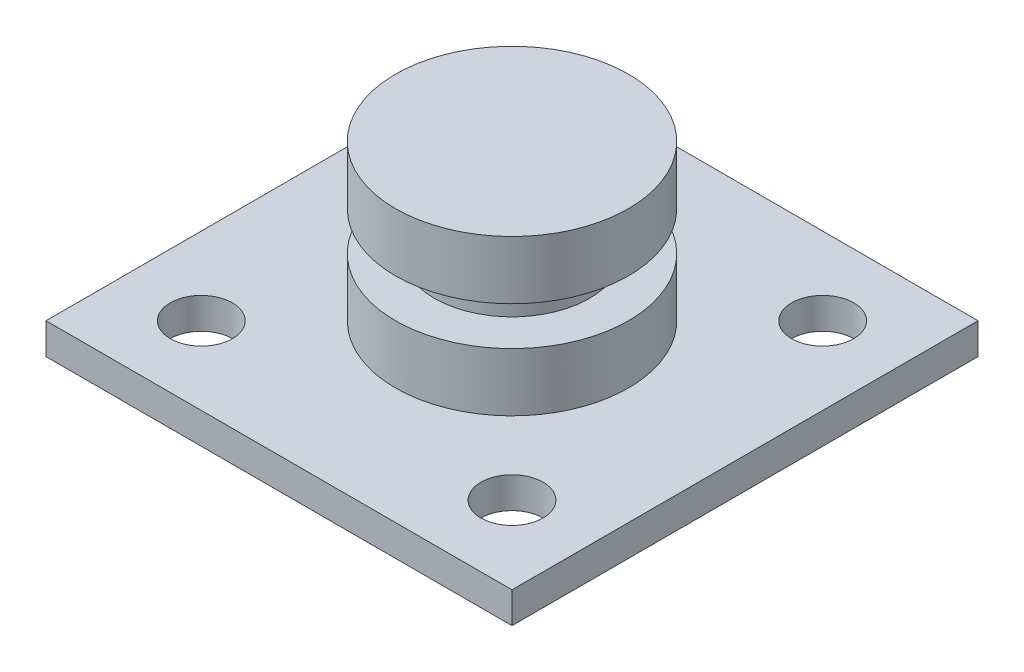
ISO-10303-21;
HEADER;
FILE_DESCRIPTION(('STEP AP214'),'2;1');
FILE_NAME('part.step','',(''),(''),'','','');
FILE_SCHEMA(('AUTOMOTIVE_DESIGN { 1 0 10303 214 1 1 1 1 }'));
ENDSEC;
DATA;
#1=APPLICATION_CONTEXT('core data for automotive mechanical design processes');
#2=APPLICATION_PROTOCOL_DEFINITION('international standard','automotive_design',2000,#1);
#3=PRODUCT_CONTEXT('',#1,'mechanical');
#4=PRODUCT('Part','Part','',(#3));
#5=PRODUCT_RELATED_PRODUCT_CATEGORY('part','',(#4));
#6=PRODUCT_DEFINITION_FORMATION('','',#4);
#7=PRODUCT_DEFINITION_CONTEXT('part definition',#1,'design');
#8=PRODUCT_DEFINITION('design','',#6,#7);
#9=PRODUCT_DEFINITION_SHAPE('','',#8);
#10=(LENGTH_UNIT() NAMED_UNIT(*) SI_UNIT(.MILLI.,.METRE.));
#11=(NAMED_UNIT(*) PLANE_ANGLE_UNIT() SI_UNIT($,.RADIAN.));
#12=(NAMED_UNIT(*) SI_UNIT($,.STERADIAN.) SOLID_ANGLE_UNIT());
#13=UNCERTAINTY_MEASURE_WITH_UNIT(LENGTH_MEASURE(1.E-05),#10,'distance_accuracy_value','');
#14=(GEOMETRIC_REPRESENTATION_CONTEXT(3) GLOBAL_UNCERTAINTY_ASSIGNED_CONTEXT((#13)) GLOBAL_UNIT_ASSIGNED_CONTEXT((#10,
#11,#12)) REPRESENTATION_CONTEXT('',''));
#15=CARTESIAN_POINT('',(0.,0.,0.));
#16=DIRECTION('',(0.,0.,1.));
#17=DIRECTION('',(1.,0.,0.));
#18=AXIS2_PLACEMENT_3D('',#15,#16,#17);
#19=CARTESIAN_POINT('',(0.,12.,0.));
#20=DIRECTION('',(0.,-1.,0.));
#21=DIRECTION('',(0.,0.,-1.));
#22=AXIS2_PLACEMENT_3D('',#19,#20,#21);
#23=CYLINDRICAL_SURFACE('',#22,7.5);
#24=CARTESIAN_POINT('',(0.,5.75,0.));
#25=DIRECTION('',(0.,-1.,0.));
#26=DIRECTION('',(0.,0.,-1.));
#27=AXIS2_PLACEMENT_3D('',#24,#25,#26);
#28=CIRCLE('',#27,7.5);
#29=CARTESIAN_POINT('',(0.,5.75,-7.5));
#30=VERTEX_POINT('',#29);
#31=EDGE_CURVE('E39',#30,#30,#28,.T.);
#32=ORIENTED_EDGE('',*,*,#31,.T.);
#33=EDGE_LOOP('',(#32));
#34=FACE_BOUND('',#33,.T.);
#35=CARTESIAN_POINT('',(0.,2.,0.));
#36=DIRECTION('',(0.,1.,0.));
#37=DIRECTION('',(0.,0.,1.));
#38=AXIS2_PLACEMENT_3D('',#35,#36,#37);
#39=CIRCLE('',#38,7.5);
#40=CARTESIAN_POINT('',(0.,2.,7.5));
#41=VERTEX_POINT('',#40);
#42=EDGE_CURVE('E129',#41,#41,#39,.T.);
#43=ORIENTED_EDGE('',*,*,#42,.T.);
#44=EDGE_LOOP('',(#43));
#45=FACE_BOUND('',#44,.T.);
#46=ADVANCED_FACE('F35',(#34,#45),#23,.T.);
#47=CARTESIAN_POINT('',(-15.,2.,15.));
#48=DIRECTION('',(1.,0.,0.));
#49=DIRECTION('',(0.,0.,-1.));
#50=AXIS2_PLACEMENT_3D('',#47,#48,#49);
#51=PLANE('',#50);
#52=DIRECTION('',(0.,0.,1.));
#53=VECTOR('',#52,1.);
#54=CARTESIAN_POINT('',(-15.,0.,15.));
#55=LINE('',#54,#53);
#56=CARTESIAN_POINT('',(-15.,0.,-15.));
#57=VERTEX_POINT('',#56);
#58=CARTESIAN_POINT('',(-15.,0.,15.));
#59=VERTEX_POINT('',#58);
#60=EDGE_CURVE('E102',#57,#59,#55,.T.);
#61=ORIENTED_EDGE('',*,*,#60,.T.);
#62=DIRECTION('',(0.,-1.,0.));
#63=VECTOR('',#62,1.);
#64=CARTESIAN_POINT('',(-15.,2.,15.));
#65=LINE('',#64,#63);
#66=CARTESIAN_POINT('',(-15.,2.,15.));
#67=VERTEX_POINT('',#66);
#68=EDGE_CURVE('E11',#67,#59,#65,.T.);
#69=ORIENTED_EDGE('',*,*,#68,.F.);
#70=DIRECTION('',(0.,0.,1.));
#71=VECTOR('',#70,1.);
#72=CARTESIAN_POINT('',(-15.,2.,15.));
#73=LINE('',#72,#71);
#74=CARTESIAN_POINT('',(-15.,2.,-15.));
#75=VERTEX_POINT('',#74);
#76=EDGE_CURVE('E89',#75,#67,#73,.T.);
#77=ORIENTED_EDGE('',*,*,#76,.F.);
#78=DIRECTION('',(0.,-1.,0.));
#79=VECTOR('',#78,1.);
#80=CARTESIAN_POINT('',(-15.,2.,-15.));
#81=LINE('',#80,#79);
#82=EDGE_CURVE('E98',#75,#57,#81,.T.);
#83=ORIENTED_EDGE('',*,*,#82,.T.);
#84=EDGE_LOOP('',(#61,#69,#77,#83));
#85=FACE_BOUND('',#84,.T.);
#86=ADVANCED_FACE('F37',(#85),#51,.F.);
#87=CARTESIAN_POINT('',(15.,2.,15.));
#88=DIRECTION('',(0.,0.,-1.));
#89=DIRECTION('',(-1.,0.,0.));
#90=AXIS2_PLACEMENT_3D('',#87,#88,#89);
#91=PLANE('',#90);
#92=DIRECTION('',(1.,0.,0.));
#93=VECTOR('',#92,1.);
#94=CARTESIAN_POINT('',(15.,0.,15.));
#95=LINE('',#94,#93);
#96=CARTESIAN_POINT('',(15.,0.,15.));
#97=VERTEX_POINT('',#96);
#98=EDGE_CURVE('E93',#59,#97,#95,.T.);
#99=ORIENTED_EDGE('',*,*,#98,.T.);
#100=DIRECTION('',(0.,-1.,0.));
#101=VECTOR('',#100,1.);
#102=CARTESIAN_POINT('',(15.,2.,15.));
#103=LINE('',#102,#101);
#104=CARTESIAN_POINT('',(15.,2.,15.));
#105=VERTEX_POINT('',#104);
#106=EDGE_CURVE('E45',#105,#97,#103,.T.);
#107=ORIENTED_EDGE('',*,*,#106,.F.);
#108=DIRECTION('',(1.,0.,0.));
#109=VECTOR('',#108,1.);
#110=CARTESIAN_POINT('',(15.,2.,15.));
#111=LINE('',#110,#109);
#112=EDGE_CURVE('E84',#67,#105,#111,.T.);
#113=ORIENTED_EDGE('',*,*,#112,.F.);
#114=ORIENTED_EDGE('',*,*,#68,.T.);
#115=EDGE_LOOP('',(#99,#107,#113,#114));
#116=FACE_BOUND('',#115,.T.);
#117=ADVANCED_FACE('F92',(#116),#91,.F.);
#118=CARTESIAN_POINT('',(15.,2.,15.));
#119=DIRECTION('',(-1.,0.,0.));
#120=DIRECTION('',(0.,0.,1.));
#121=AXIS2_PLACEMENT_3D('',#118,#119,#120);
#122=PLANE('',#121);
#123=DIRECTION('',(0.,0.,-1.));
#124=VECTOR('',#123,1.);
#125=CARTESIAN_POINT('',(15.,0.,15.));
#126=LINE('',#125,#124);
#127=CARTESIAN_POINT('',(15.,0.,-15.));
#128=VERTEX_POINT('',#127);
#129=EDGE_CURVE('E71',#97,#128,#126,.T.);
#130=ORIENTED_EDGE('',*,*,#129,.T.);
#131=DIRECTION('',(0.,-1.,0.));
#132=VECTOR('',#131,1.);
#133=CARTESIAN_POINT('',(15.,2.,-15.));
#134=LINE('',#133,#132);
#135=CARTESIAN_POINT('',(15.,2.,-15.));
#136=VERTEX_POINT('',#135);
#137=EDGE_CURVE('E94',#136,#128,#134,.T.);
#138=ORIENTED_EDGE('',*,*,#137,.F.);
#139=DIRECTION('',(0.,0.,-1.));
#140=VECTOR('',#139,1.);
#141=CARTESIAN_POINT('',(15.,2.,15.));
#142=LINE('',#141,#140);
#143=EDGE_CURVE('E87',#105,#136,#142,.T.);
#144=ORIENTED_EDGE('',*,*,#143,.F.);
#145=ORIENTED_EDGE('',*,*,#106,.T.);
#146=EDGE_LOOP('',(#130,#138,#144,#145));
#147=FACE_BOUND('',#146,.T.);
#148=ADVANCED_FACE('F96',(#147),#122,.F.);
#149=CARTESIAN_POINT('',(15.,2.,-15.));
#150=DIRECTION('',(0.,0.,1.));
#151=DIRECTION('',(1.,0.,0.));
#152=AXIS2_PLACEMENT_3D('',#149,#150,#151);
#153=PLANE('',#152);
#154=DIRECTION('',(-1.,0.,0.));
#155=VECTOR('',#154,1.);
#156=CARTESIAN_POINT('',(15.,0.,-15.));
#157=LINE('',#156,#155);
#158=EDGE_CURVE('E77',#128,#57,#157,.T.);
#159=ORIENTED_EDGE('',*,*,#158,.T.);
#160=ORIENTED_EDGE('',*,*,#82,.F.);
#161=DIRECTION('',(-1.,0.,0.));
#162=VECTOR('',#161,1.);
#163=CARTESIAN_POINT('',(15.,2.,-15.));
#164=LINE('',#163,#162);
#165=EDGE_CURVE('E54',#136,#75,#164,.T.);
#166=ORIENTED_EDGE('',*,*,#165,.F.);
#167=ORIENTED_EDGE('',*,*,#137,.T.);
#168=EDGE_LOOP('',(#159,#160,#166,#167));
#169=FACE_BOUND('',#168,.T.);
#170=ADVANCED_FACE('F159',(#169),#153,.F.);
#171=CARTESIAN_POINT('',(0.,2.,0.));
#172=DIRECTION('',(0.,1.,0.));
#173=DIRECTION('',(0.,0.,1.));
#174=AXIS2_PLACEMENT_3D('',#171,#172,#173);
#175=PLANE('',#174);
#176=ORIENTED_EDGE('',*,*,#42,.F.);
#177=EDGE_LOOP('',(#176));
#178=FACE_BOUND('',#177,.T.);
#179=CARTESIAN_POINT('',(9.99999999999999,2.,-10.));
#180=DIRECTION('',(0.,1.,0.));
#181=DIRECTION('',(0.,0.,1.));
#182=AXIS2_PLACEMENT_3D('',#179,#180,#181);
#183=CIRCLE('',#182,2.);
#184=CARTESIAN_POINT('',(9.99999999999999,2.,-8.));
#185=VERTEX_POINT('',#184);
#186=EDGE_CURVE('E118',#185,#185,#183,.T.);
#187=ORIENTED_EDGE('',*,*,#186,.F.);
#188=EDGE_LOOP('',(#187));
#189=FACE_BOUND('',#188,.T.);
#190=CARTESIAN_POINT('',(9.99999999999999,2.,10.));
#191=DIRECTION('',(0.,1.,0.));
#192=DIRECTION('',(0.,0.,1.));
#193=AXIS2_PLACEMENT_3D('',#190,#191,#192);
#194=CIRCLE('',#193,2.);
#195=CARTESIAN_POINT('',(9.99999999999999,2.,12.));
#196=VERTEX_POINT('',#195);
#197=EDGE_CURVE('E146',#196,#196,#194,.T.);
#198=ORIENTED_EDGE('',*,*,#197,.F.);
#199=EDGE_LOOP('',(#198));
#200=FACE_BOUND('',#199,.T.);
#201=CARTESIAN_POINT('',(-10.,2.,10.));
#202=DIRECTION('',(0.,1.,0.));
#203=DIRECTION('',(0.,0.,1.));
#204=AXIS2_PLACEMENT_3D('',#201,#202,#203);
#205=CIRCLE('',#204,2.);
#206=CARTESIAN_POINT('',(-10.,2.,12.));
#207=VERTEX_POINT('',#206);
#208=EDGE_CURVE('E141',#207,#207,#205,.T.);
#209=ORIENTED_EDGE('',*,*,#208,.F.);
#210=EDGE_LOOP('',(#209));
#211=FACE_BOUND('',#210,.T.);
#212=CARTESIAN_POINT('',(-10.,2.,-10.));
#213=DIRECTION('',(0.,1.,0.));
#214=DIRECTION('',(0.,0.,1.));
#215=AXIS2_PLACEMENT_3D('',#212,#213,#214);
#216=CIRCLE('',#215,2.);
#217=CARTESIAN_POINT('',(-10.,2.,-8.));
#218=VERTEX_POINT('',#217);
#219=EDGE_CURVE('E113',#218,#218,#216,.T.);
#220=ORIENTED_EDGE('',*,*,#219,.F.);
#221=EDGE_LOOP('',(#220));
#222=FACE_BOUND('',#221,.T.);
#223=ORIENTED_EDGE('',*,*,#76,.T.);
#224=ORIENTED_EDGE('',*,*,#112,.T.);
#225=ORIENTED_EDGE('',*,*,#143,.T.);
#226=ORIENTED_EDGE('',*,*,#165,.T.);
#227=EDGE_LOOP('',(#223,#224,#225,#226));
#228=FACE_BOUND('',#227,.T.);
#229=ADVANCED_FACE('F85',(#178,#189,#200,#211,#222,#228),#175,.T.);
#230=CARTESIAN_POINT('',(0.,0.,0.));
#231=DIRECTION('',(0.,1.,0.));
#232=DIRECTION('',(0.,0.,1.));
#233=AXIS2_PLACEMENT_3D('',#230,#231,#232);
#234=PLANE('',#233);
#235=CARTESIAN_POINT('',(9.99999999999999,0.,-10.));
#236=DIRECTION('',(0.,1.,0.));
#237=DIRECTION('',(0.,0.,1.));
#238=AXIS2_PLACEMENT_3D('',#235,#236,#237);
#239=CIRCLE('',#238,2.);
#240=CARTESIAN_POINT('',(9.99999999999999,0.,-8.));
#241=VERTEX_POINT('',#240);
#242=EDGE_CURVE('E121',#241,#241,#239,.T.);
#243=ORIENTED_EDGE('',*,*,#242,.T.);
#244=EDGE_LOOP('',(#243));
#245=FACE_BOUND('',#244,.T.);
#246=CARTESIAN_POINT('',(9.99999999999999,0.,10.));
#247=DIRECTION('',(0.,1.,0.));
#248=DIRECTION('',(0.,0.,1.));
#249=AXIS2_PLACEMENT_3D('',#246,#247,#248);
#250=CIRCLE('',#249,2.);
#251=CARTESIAN_POINT('',(9.99999999999999,0.,12.));
#252=VERTEX_POINT('',#251);
#253=EDGE_CURVE('E117',#252,#252,#250,.T.);
#254=ORIENTED_EDGE('',*,*,#253,.T.);
#255=EDGE_LOOP('',(#254));
#256=FACE_BOUND('',#255,.T.);
#257=CARTESIAN_POINT('',(-10.,0.,10.));
#258=DIRECTION('',(0.,1.,0.));
#259=DIRECTION('',(0.,0.,1.));
#260=AXIS2_PLACEMENT_3D('',#257,#258,#259);
#261=CIRCLE('',#260,2.);
#262=CARTESIAN_POINT('',(-10.,0.,12.));
#263=VERTEX_POINT('',#262);
#264=EDGE_CURVE('E114',#263,#263,#261,.T.);
#265=ORIENTED_EDGE('',*,*,#264,.T.);
#266=EDGE_LOOP('',(#265));
#267=FACE_BOUND('',#266,.T.);
#268=CARTESIAN_POINT('',(-10.,0.,-10.));
#269=DIRECTION('',(0.,1.,0.));
#270=DIRECTION('',(0.,0.,1.));
#271=AXIS2_PLACEMENT_3D('',#268,#269,#270);
#272=CIRCLE('',#271,2.);
#273=CARTESIAN_POINT('',(-10.,0.,-8.));
#274=VERTEX_POINT('',#273);
#275=EDGE_CURVE('E105',#274,#274,#272,.T.);
#276=ORIENTED_EDGE('',*,*,#275,.T.);
#277=EDGE_LOOP('',(#276));
#278=FACE_BOUND('',#277,.T.);
#279=ORIENTED_EDGE('',*,*,#60,.F.);
#280=ORIENTED_EDGE('',*,*,#158,.F.);
#281=ORIENTED_EDGE('',*,*,#129,.F.);
#282=ORIENTED_EDGE('',*,*,#98,.F.);
#283=EDGE_LOOP('',(#279,#280,#281,#282));
#284=FACE_BOUND('',#283,.T.);
#285=ADVANCED_FACE('F158',(#245,#256,#267,#278,#284),#234,.F.);
#286=CARTESIAN_POINT('',(-10.,-3.,-10.));
#287=DIRECTION('',(0.,1.,0.));
#288=DIRECTION('',(0.,0.,1.));
#289=AXIS2_PLACEMENT_3D('',#286,#287,#288);
#290=CYLINDRICAL_SURFACE('',#289,2.);
#291=ORIENTED_EDGE('',*,*,#219,.T.);
#292=EDGE_LOOP('',(#291));
#293=FACE_BOUND('',#292,.T.);
#294=ORIENTED_EDGE('',*,*,#275,.F.);
#295=EDGE_LOOP('',(#294));
#296=FACE_BOUND('',#295,.T.);
#297=ADVANCED_FACE('F154',(#293,#296),#290,.F.);
#298=CARTESIAN_POINT('',(-10.,-3.,10.));
#299=DIRECTION('',(0.,1.,0.));
#300=DIRECTION('',(0.,0.,1.));
#301=AXIS2_PLACEMENT_3D('',#298,#299,#300);
#302=CYLINDRICAL_SURFACE('',#301,2.);
#303=ORIENTED_EDGE('',*,*,#208,.T.);
#304=EDGE_LOOP('',(#303));
#305=FACE_BOUND('',#304,.T.);
#306=ORIENTED_EDGE('',*,*,#264,.F.);
#307=EDGE_LOOP('',(#306));
#308=FACE_BOUND('',#307,.T.);
#309=ADVANCED_FACE('F258',(#305,#308),#302,.F.);
#310=CARTESIAN_POINT('',(9.99999999999999,-3.,10.));
#311=DIRECTION('',(0.,1.,0.));
#312=DIRECTION('',(0.,0.,1.));
#313=AXIS2_PLACEMENT_3D('',#310,#311,#312);
#314=CYLINDRICAL_SURFACE('',#313,2.);
#315=ORIENTED_EDGE('',*,*,#197,.T.);
#316=EDGE_LOOP('',(#315));
#317=FACE_BOUND('',#316,.T.);
#318=ORIENTED_EDGE('',*,*,#253,.F.);
#319=EDGE_LOOP('',(#318));
#320=FACE_BOUND('',#319,.T.);
#321=ADVANCED_FACE('F252',(#317,#320),#314,.F.);
#322=CARTESIAN_POINT('',(9.99999999999999,-3.,-10.));
#323=DIRECTION('',(0.,1.,0.));
#324=DIRECTION('',(0.,0.,1.));
#325=AXIS2_PLACEMENT_3D('',#322,#323,#324);
#326=CYLINDRICAL_SURFACE('',#325,2.);
#327=ORIENTED_EDGE('',*,*,#186,.T.);
#328=EDGE_LOOP('',(#327));
#329=FACE_BOUND('',#328,.T.);
#330=ORIENTED_EDGE('',*,*,#242,.F.);
#331=EDGE_LOOP('',(#330));
#332=FACE_BOUND('',#331,.T.);
#333=ADVANCED_FACE('F201',(#329,#332),#326,.F.);
#334=CARTESIAN_POINT('',(0.,5.75,5.));
#335=DIRECTION('',(0.,-1.,0.));
#336=DIRECTION('',(0.,0.,-1.));
#337=AXIS2_PLACEMENT_3D('',#334,#335,#336);
#338=PLANE('',#337);
#339=CARTESIAN_POINT('',(0.,5.75,0.));
#340=DIRECTION('',(0.,1.,0.));
#341=DIRECTION('',(0.,0.,1.));
#342=AXIS2_PLACEMENT_3D('',#339,#340,#341);
#343=CIRCLE('',#342,5.);
#344=CARTESIAN_POINT('',(0.,5.75,5.));
#345=VERTEX_POINT('',#344);
#346=EDGE_CURVE('E125',#345,#345,#343,.T.);
#347=ORIENTED_EDGE('',*,*,#346,.F.);
#348=EDGE_LOOP('',(#347));
#349=FACE_BOUND('',#348,.T.);
#350=ORIENTED_EDGE('',*,*,#31,.F.);
#351=EDGE_LOOP('',(#350));
#352=FACE_BOUND('',#351,.T.);
#353=ADVANCED_FACE('F199',(#349,#352),#338,.F.);
#354=CARTESIAN_POINT('',(0.,8.25,5.));
#355=DIRECTION('',(0.,1.,0.));
#356=DIRECTION('',(0.,0.,1.));
#357=AXIS2_PLACEMENT_3D('',#354,#355,#356);
#358=PLANE('',#357);
#359=CARTESIAN_POINT('',(0.,8.25,0.));
#360=DIRECTION('',(0.,1.,0.));
#361=DIRECTION('',(0.,0.,1.));
#362=AXIS2_PLACEMENT_3D('',#359,#360,#361);
#363=CIRCLE('',#362,5.);
#364=CARTESIAN_POINT('',(0.,8.25,5.));
#365=VERTEX_POINT('',#364);
#366=EDGE_CURVE('E131',#365,#365,#363,.T.);
#367=ORIENTED_EDGE('',*,*,#366,.T.);
#368=EDGE_LOOP('',(#367));
#369=FACE_BOUND('',#368,.T.);
#370=CARTESIAN_POINT('',(0.,8.25,0.));
#371=DIRECTION('',(0.,1.,0.));
#372=DIRECTION('',(0.,0.,1.));
#373=AXIS2_PLACEMENT_3D('',#370,#371,#372);
#374=CIRCLE('',#373,7.5);
#375=CARTESIAN_POINT('',(0.,8.25,7.5));
#376=VERTEX_POINT('',#375);
#377=EDGE_CURVE('E123',#376,#376,#374,.T.);
#378=ORIENTED_EDGE('',*,*,#377,.F.);
#379=EDGE_LOOP('',(#378));
#380=FACE_BOUND('',#379,.T.);
#381=ADVANCED_FACE('F195',(#369,#380),#358,.F.);
#382=CARTESIAN_POINT('',(0.,16.4440129070994,0.));
#383=DIRECTION('',(0.,1.,0.));
#384=DIRECTION('',(0.,0.,1.));
#385=AXIS2_PLACEMENT_3D('',#382,#383,#384);
#386=CYLINDRICAL_SURFACE('',#385,5.);
#387=ORIENTED_EDGE('',*,*,#366,.F.);
#388=EDGE_LOOP('',(#387));
#389=FACE_BOUND('',#388,.T.);
#390=ORIENTED_EDGE('',*,*,#346,.T.);
#391=EDGE_LOOP('',(#390));
#392=FACE_BOUND('',#391,.T.);
#393=ADVANCED_FACE('F188',(#389,#392),#386,.T.);
#394=CARTESIAN_POINT('',(0.,12.,0.));
#395=DIRECTION('',(0.,1.,0.));
#396=DIRECTION('',(0.,0.,1.));
#397=AXIS2_PLACEMENT_3D('',#394,#395,#396);
#398=PLANE('',#397);
#399=CARTESIAN_POINT('',(0.,12.,0.));
#400=DIRECTION('',(0.,1.,0.));
#401=DIRECTION('',(0.,0.,1.));
#402=AXIS2_PLACEMENT_3D('',#399,#400,#401);
#403=CIRCLE('',#402,7.5);
#404=CARTESIAN_POINT('',(0.,12.,7.5));
#405=VERTEX_POINT('',#404);
#406=EDGE_CURVE('E138',#405,#405,#403,.T.);
#407=ORIENTED_EDGE('',*,*,#406,.T.);
#408=EDGE_LOOP('',(#407));
#409=FACE_BOUND('',#408,.T.);
#410=ADVANCED_FACE('F184',(#409),#398,.T.);
#411=ORIENTED_EDGE('',*,*,#377,.T.);
#412=EDGE_LOOP('',(#411));
#413=FACE_BOUND('',#412,.T.);
#414=ORIENTED_EDGE('',*,*,#406,.F.);
#415=EDGE_LOOP('',(#414));
#416=FACE_BOUND('',#415,.T.);
#417=ADVANCED_FACE('F175',(#413,#416),#23,.T.);
#418=CLOSED_SHELL('',(#46,#86,#117,#148,#170,#229,#285,#297,#309,#321,#333,#353,#381,#393,#410,#417));
#419=MANIFOLD_SOLID_BREP('B2',#418);
#420=ADVANCED_BREP_SHAPE_REPRESENTATION('',(#18,#419),#14);
#421=SHAPE_DEFINITION_REPRESENTATION(#9,#420);
ENDSEC;
END-ISO-10303-21;
